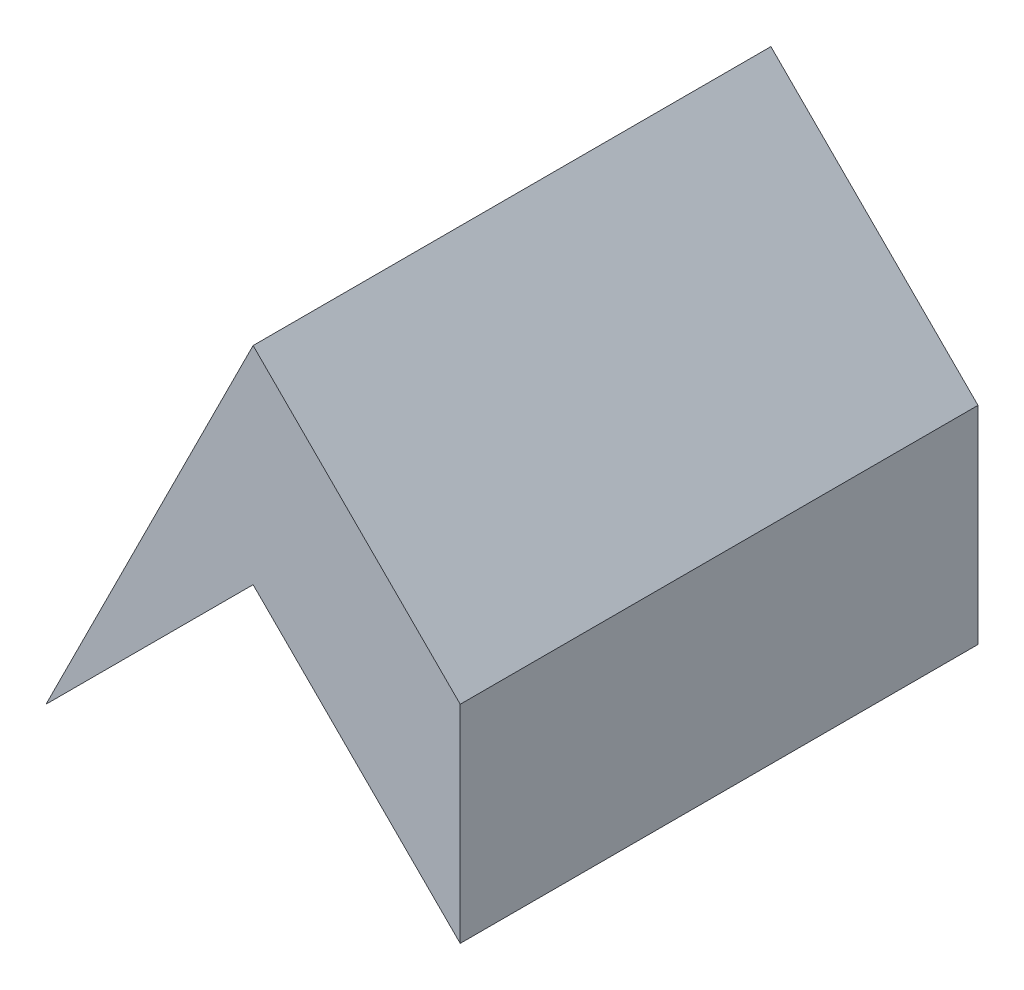
ISO-10303-21;
HEADER;
FILE_DESCRIPTION(('STEP AP214'),'2;1');
FILE_NAME('part.step','',(''),(''),'','','');
FILE_SCHEMA(('AUTOMOTIVE_DESIGN { 1 0 10303 214 1 1 1 1 }'));
ENDSEC;
DATA;
#1=APPLICATION_CONTEXT('core data for automotive mechanical design processes');
#2=APPLICATION_PROTOCOL_DEFINITION('international standard','automotive_design',2000,#1);
#3=PRODUCT_CONTEXT('',#1,'mechanical');
#4=PRODUCT('Part','Part','',(#3));
#5=PRODUCT_RELATED_PRODUCT_CATEGORY('part','',(#4));
#6=PRODUCT_DEFINITION_FORMATION('','',#4);
#7=PRODUCT_DEFINITION_CONTEXT('part definition',#1,'design');
#8=PRODUCT_DEFINITION('design','',#6,#7);
#9=PRODUCT_DEFINITION_SHAPE('','',#8);
#10=(LENGTH_UNIT() NAMED_UNIT(*) SI_UNIT(.MILLI.,.METRE.));
#11=(NAMED_UNIT(*) PLANE_ANGLE_UNIT() SI_UNIT($,.RADIAN.));
#12=(NAMED_UNIT(*) SI_UNIT($,.STERADIAN.) SOLID_ANGLE_UNIT());
#13=UNCERTAINTY_MEASURE_WITH_UNIT(LENGTH_MEASURE(1.E-05),#10,'distance_accuracy_value','');
#14=(GEOMETRIC_REPRESENTATION_CONTEXT(3) GLOBAL_UNCERTAINTY_ASSIGNED_CONTEXT((#13)) GLOBAL_UNIT_ASSIGNED_CONTEXT((#10,
#11,#12)) REPRESENTATION_CONTEXT('',''));
#15=CARTESIAN_POINT('',(0.,0.,0.));
#16=DIRECTION('',(0.,0.,1.));
#17=DIRECTION('',(1.,0.,0.));
#18=AXIS2_PLACEMENT_3D('',#15,#16,#17);
#19=CARTESIAN_POINT('',(-10.,10.,25.));
#20=DIRECTION('',(-0.707106781186548,0.707106781186547,0.));
#21=DIRECTION('',(-0.707106781186547,-0.707106781186548,0.));
#22=AXIS2_PLACEMENT_3D('',#19,#20,#21);
#23=PLANE('',#22);
#24=DIRECTION('',(0.707106781186547,0.707106781186548,0.));
#25=VECTOR('',#24,1.);
#26=CARTESIAN_POINT('',(-10.,10.,0.));
#27=LINE('',#26,#25);
#28=CARTESIAN_POINT('',(-20.,0.,0.));
#29=VERTEX_POINT('',#28);
#30=CARTESIAN_POINT('',(-10.,10.,0.));
#31=VERTEX_POINT('',#30);
#32=EDGE_CURVE('E107',#29,#31,#27,.T.);
#33=ORIENTED_EDGE('',*,*,#32,.T.);
#34=DIRECTION('',(0.,0.,-1.));
#35=VECTOR('',#34,1.);
#36=CARTESIAN_POINT('',(-10.,10.,25.));
#37=LINE('',#36,#35);
#38=CARTESIAN_POINT('',(-10.,10.,25.));
#39=VERTEX_POINT('',#38);
#40=EDGE_CURVE('E11',#39,#31,#37,.T.);
#41=ORIENTED_EDGE('',*,*,#40,.F.);
#42=DIRECTION('',(0.707106781186547,0.707106781186548,0.));
#43=VECTOR('',#42,1.);
#44=CARTESIAN_POINT('',(-10.,10.,25.));
#45=LINE('',#44,#43);
#46=CARTESIAN_POINT('',(-20.,0.,25.));
#47=VERTEX_POINT('',#46);
#48=EDGE_CURVE('E115',#47,#39,#45,.T.);
#49=ORIENTED_EDGE('',*,*,#48,.F.);
#50=DIRECTION('',(0.,0.,-1.));
#51=VECTOR('',#50,1.);
#52=CARTESIAN_POINT('',(-20.,0.,25.));
#53=LINE('',#52,#51);
#54=EDGE_CURVE('E103',#47,#29,#53,.T.);
#55=ORIENTED_EDGE('',*,*,#54,.T.);
#56=EDGE_LOOP('',(#33,#41,#49,#55));
#57=FACE_BOUND('',#56,.T.);
#58=ADVANCED_FACE('F33',(#57),#23,.F.);
#59=CARTESIAN_POINT('',(0.,0.,25.));
#60=DIRECTION('',(0.707106781186548,0.707106781186548,0.));
#61=DIRECTION('',(-0.707106781186548,0.707106781186548,0.));
#62=AXIS2_PLACEMENT_3D('',#59,#60,#61);
#63=PLANE('',#62);
#64=DIRECTION('',(0.707106781186548,-0.707106781186548,0.));
#65=VECTOR('',#64,1.);
#66=CARTESIAN_POINT('',(0.,0.,0.));
#67=LINE('',#66,#65);
#68=CARTESIAN_POINT('',(0.,0.,0.));
#69=VERTEX_POINT('',#68);
#70=EDGE_CURVE('E110',#31,#69,#67,.T.);
#71=ORIENTED_EDGE('',*,*,#70,.T.);
#72=DIRECTION('',(0.,0.,-1.));
#73=VECTOR('',#72,1.);
#74=CARTESIAN_POINT('',(0.,0.,25.));
#75=LINE('',#74,#73);
#76=CARTESIAN_POINT('',(0.,0.,25.));
#77=VERTEX_POINT('',#76);
#78=EDGE_CURVE('E41',#77,#69,#75,.T.);
#79=ORIENTED_EDGE('',*,*,#78,.F.);
#80=DIRECTION('',(0.707106781186548,-0.707106781186548,0.));
#81=VECTOR('',#80,1.);
#82=CARTESIAN_POINT('',(0.,0.,25.));
#83=LINE('',#82,#81);
#84=EDGE_CURVE('E83',#39,#77,#83,.T.);
#85=ORIENTED_EDGE('',*,*,#84,.F.);
#86=ORIENTED_EDGE('',*,*,#40,.T.);
#87=EDGE_LOOP('',(#71,#79,#85,#86));
#88=FACE_BOUND('',#87,.T.);
#89=ADVANCED_FACE('F134',(#88),#63,.F.);
#90=CARTESIAN_POINT('',(0.,10.,25.));
#91=DIRECTION('',(-1.,0.,0.));
#92=DIRECTION('',(0.,0.,1.));
#93=AXIS2_PLACEMENT_3D('',#90,#91,#92);
#94=PLANE('',#93);
#95=DIRECTION('',(0.,1.,0.));
#96=VECTOR('',#95,1.);
#97=CARTESIAN_POINT('',(0.,10.,0.));
#98=LINE('',#97,#96);
#99=CARTESIAN_POINT('',(0.,10.,0.));
#100=VERTEX_POINT('',#99);
#101=EDGE_CURVE('E98',#69,#100,#98,.T.);
#102=ORIENTED_EDGE('',*,*,#101,.T.);
#103=DIRECTION('',(0.,0.,-1.));
#104=VECTOR('',#103,1.);
#105=CARTESIAN_POINT('',(0.,10.,25.));
#106=LINE('',#105,#104);
#107=CARTESIAN_POINT('',(0.,10.,25.));
#108=VERTEX_POINT('',#107);
#109=EDGE_CURVE('E95',#108,#100,#106,.T.);
#110=ORIENTED_EDGE('',*,*,#109,.F.);
#111=DIRECTION('',(0.,1.,0.));
#112=VECTOR('',#111,1.);
#113=CARTESIAN_POINT('',(0.,10.,25.));
#114=LINE('',#113,#112);
#115=EDGE_CURVE('E87',#77,#108,#114,.T.);
#116=ORIENTED_EDGE('',*,*,#115,.F.);
#117=ORIENTED_EDGE('',*,*,#78,.T.);
#118=EDGE_LOOP('',(#102,#110,#116,#117));
#119=FACE_BOUND('',#118,.T.);
#120=ADVANCED_FACE('F96',(#119),#94,.F.);
#121=CARTESIAN_POINT('',(-10.,20.,25.));
#122=DIRECTION('',(-0.707106781186547,-0.707106781186548,0.));
#123=DIRECTION('',(0.707106781186548,-0.707106781186547,0.));
#124=AXIS2_PLACEMENT_3D('',#121,#122,#123);
#125=PLANE('',#124);
#126=DIRECTION('',(-0.707106781186548,0.707106781186547,0.));
#127=VECTOR('',#126,1.);
#128=CARTESIAN_POINT('',(-10.,20.,0.));
#129=LINE('',#128,#127);
#130=CARTESIAN_POINT('',(-10.,20.,0.));
#131=VERTEX_POINT('',#130);
#132=EDGE_CURVE('E69',#100,#131,#129,.T.);
#133=ORIENTED_EDGE('',*,*,#132,.T.);
#134=DIRECTION('',(0.,0.,-1.));
#135=VECTOR('',#134,1.);
#136=CARTESIAN_POINT('',(-10.,20.,25.));
#137=LINE('',#136,#135);
#138=CARTESIAN_POINT('',(-10.,20.,25.));
#139=VERTEX_POINT('',#138);
#140=EDGE_CURVE('E99',#139,#131,#137,.T.);
#141=ORIENTED_EDGE('',*,*,#140,.F.);
#142=DIRECTION('',(-0.707106781186548,0.707106781186547,0.));
#143=VECTOR('',#142,1.);
#144=CARTESIAN_POINT('',(-10.,20.,25.));
#145=LINE('',#144,#143);
#146=EDGE_CURVE('E91',#108,#139,#145,.T.);
#147=ORIENTED_EDGE('',*,*,#146,.F.);
#148=ORIENTED_EDGE('',*,*,#109,.T.);
#149=EDGE_LOOP('',(#133,#141,#147,#148));
#150=FACE_BOUND('',#149,.T.);
#151=ADVANCED_FACE('F101',(#150),#125,.F.);
#152=CARTESIAN_POINT('',(-20.,0.,25.));
#153=DIRECTION('',(0.894427190999916,-0.447213595499958,0.));
#154=DIRECTION('',(0.447213595499958,0.894427190999916,0.));
#155=AXIS2_PLACEMENT_3D('',#152,#153,#154);
#156=PLANE('',#155);
#157=DIRECTION('',(-0.447213595499958,-0.894427190999916,0.));
#158=VECTOR('',#157,1.);
#159=CARTESIAN_POINT('',(-20.,0.,0.));
#160=LINE('',#159,#158);
#161=EDGE_CURVE('E75',#131,#29,#160,.T.);
#162=ORIENTED_EDGE('',*,*,#161,.T.);
#163=ORIENTED_EDGE('',*,*,#54,.F.);
#164=DIRECTION('',(-0.447213595499958,-0.894427190999916,0.));
#165=VECTOR('',#164,1.);
#166=CARTESIAN_POINT('',(-20.,0.,25.));
#167=LINE('',#166,#165);
#168=EDGE_CURVE('E49',#139,#47,#167,.T.);
#169=ORIENTED_EDGE('',*,*,#168,.F.);
#170=ORIENTED_EDGE('',*,*,#140,.T.);
#171=EDGE_LOOP('',(#162,#163,#169,#170));
#172=FACE_BOUND('',#171,.T.);
#173=ADVANCED_FACE('F123',(#172),#156,.F.);
#174=CARTESIAN_POINT('',(0.,0.,25.));
#175=DIRECTION('',(0.,0.,1.));
#176=DIRECTION('',(1.,0.,0.));
#177=AXIS2_PLACEMENT_3D('',#174,#175,#176);
#178=PLANE('',#177);
#179=ORIENTED_EDGE('',*,*,#48,.T.);
#180=ORIENTED_EDGE('',*,*,#84,.T.);
#181=ORIENTED_EDGE('',*,*,#115,.T.);
#182=ORIENTED_EDGE('',*,*,#146,.T.);
#183=ORIENTED_EDGE('',*,*,#168,.T.);
#184=EDGE_LOOP('',(#179,#180,#181,#182,#183));
#185=FACE_BOUND('',#184,.T.);
#186=ADVANCED_FACE('F89',(#185),#178,.T.);
#187=CARTESIAN_POINT('',(0.,0.,0.));
#188=DIRECTION('',(0.,0.,1.));
#189=DIRECTION('',(1.,0.,0.));
#190=AXIS2_PLACEMENT_3D('',#187,#188,#189);
#191=PLANE('',#190);
#192=ORIENTED_EDGE('',*,*,#32,.F.);
#193=ORIENTED_EDGE('',*,*,#161,.F.);
#194=ORIENTED_EDGE('',*,*,#132,.F.);
#195=ORIENTED_EDGE('',*,*,#101,.F.);
#196=ORIENTED_EDGE('',*,*,#70,.F.);
#197=EDGE_LOOP('',(#192,#193,#194,#195,#196));
#198=FACE_BOUND('',#197,.T.);
#199=ADVANCED_FACE('F119',(#198),#191,.F.);
#200=CLOSED_SHELL('',(#58,#89,#120,#151,#173,#186,#199));
#201=MANIFOLD_SOLID_BREP('B2',#200);
#202=ADVANCED_BREP_SHAPE_REPRESENTATION('',(#18,#201),#14);
#203=SHAPE_DEFINITION_REPRESENTATION(#9,#202);
ENDSEC;
END-ISO-10303-21;
